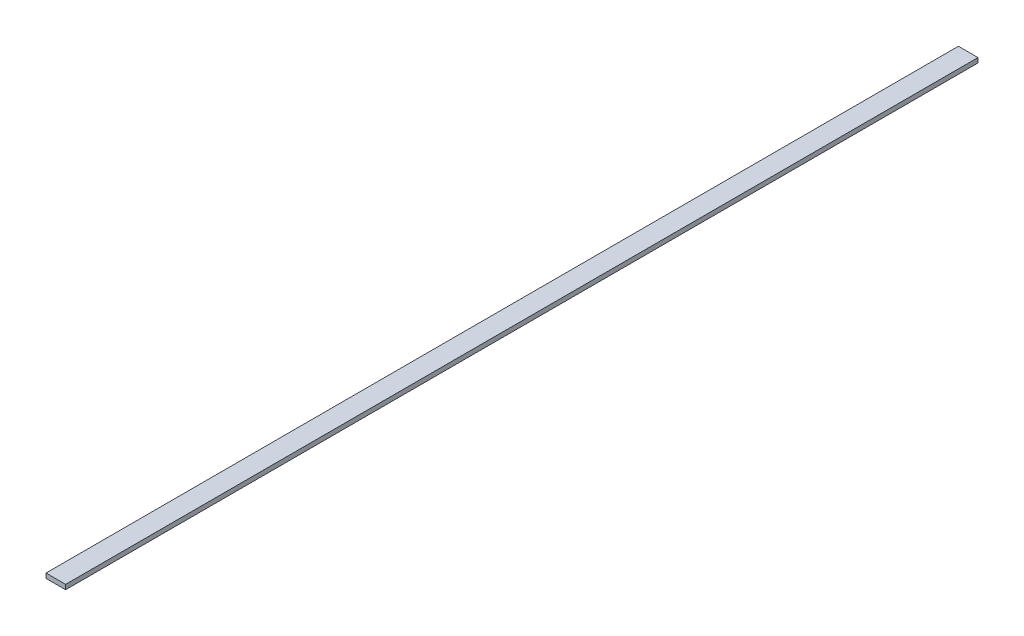
ISO-10303-21;
HEADER;
FILE_DESCRIPTION(('STEP AP214'),'2;1');
FILE_NAME('part.step','',(''),(''),'','','');
FILE_SCHEMA(('AUTOMOTIVE_DESIGN { 1 0 10303 214 1 1 1 1 }'));
ENDSEC;
DATA;
#1=APPLICATION_CONTEXT('core data for automotive mechanical design processes');
#2=APPLICATION_PROTOCOL_DEFINITION('international standard','automotive_design',2000,#1);
#3=PRODUCT_CONTEXT('',#1,'mechanical');
#4=PRODUCT('Part','Part','',(#3));
#5=PRODUCT_RELATED_PRODUCT_CATEGORY('part','',(#4));
#6=PRODUCT_DEFINITION_FORMATION('','',#4);
#7=PRODUCT_DEFINITION_CONTEXT('part definition',#1,'design');
#8=PRODUCT_DEFINITION('design','',#6,#7);
#9=PRODUCT_DEFINITION_SHAPE('','',#8);
#10=(LENGTH_UNIT() NAMED_UNIT(*) SI_UNIT(.MILLI.,.METRE.));
#11=(NAMED_UNIT(*) PLANE_ANGLE_UNIT() SI_UNIT($,.RADIAN.));
#12=(NAMED_UNIT(*) SI_UNIT($,.STERADIAN.) SOLID_ANGLE_UNIT());
#13=UNCERTAINTY_MEASURE_WITH_UNIT(LENGTH_MEASURE(1.E-05),#10,'distance_accuracy_value','');
#14=(GEOMETRIC_REPRESENTATION_CONTEXT(3) GLOBAL_UNCERTAINTY_ASSIGNED_CONTEXT((#13)) GLOBAL_UNIT_ASSIGNED_CONTEXT((#10,
#11,#12)) REPRESENTATION_CONTEXT('',''));
#15=CARTESIAN_POINT('',(0.,0.,0.));
#16=DIRECTION('',(0.,0.,1.));
#17=DIRECTION('',(1.,0.,0.));
#18=AXIS2_PLACEMENT_3D('',#15,#16,#17);
#19=CARTESIAN_POINT('',(0.,0.,295.41216));
#20=DIRECTION('',(1.,0.,0.));
#21=DIRECTION('',(0.,0.,-1.));
#22=AXIS2_PLACEMENT_3D('',#19,#20,#21);
#23=PLANE('',#22);
#24=DIRECTION('',(0.,-1.,0.));
#25=VECTOR('',#24,1.);
#26=CARTESIAN_POINT('',(0.,0.,0.));
#27=LINE('',#26,#25);
#28=CARTESIAN_POINT('',(0.,1.51892,0.));
#29=VERTEX_POINT('',#28);
#30=CARTESIAN_POINT('',(0.,0.,0.));
#31=VERTEX_POINT('',#30);
#32=EDGE_CURVE('E97',#29,#31,#27,.T.);
#33=ORIENTED_EDGE('',*,*,#32,.T.);
#34=DIRECTION('',(0.,0.,-1.));
#35=VECTOR('',#34,1.);
#36=CARTESIAN_POINT('',(0.,0.,295.41216));
#37=LINE('',#36,#35);
#38=CARTESIAN_POINT('',(0.,0.,295.41216));
#39=VERTEX_POINT('',#38);
#40=EDGE_CURVE('E11',#39,#31,#37,.T.);
#41=ORIENTED_EDGE('',*,*,#40,.F.);
#42=DIRECTION('',(0.,-1.,0.));
#43=VECTOR('',#42,1.);
#44=CARTESIAN_POINT('',(0.,0.,295.41216));
#45=LINE('',#44,#43);
#46=CARTESIAN_POINT('',(0.,1.51892,295.41216));
#47=VERTEX_POINT('',#46);
#48=EDGE_CURVE('E85',#47,#39,#45,.T.);
#49=ORIENTED_EDGE('',*,*,#48,.F.);
#50=DIRECTION('',(0.,0.,-1.));
#51=VECTOR('',#50,1.);
#52=CARTESIAN_POINT('',(0.,1.51892,295.41216));
#53=LINE('',#52,#51);
#54=EDGE_CURVE('E93',#47,#29,#53,.T.);
#55=ORIENTED_EDGE('',*,*,#54,.T.);
#56=EDGE_LOOP('',(#33,#41,#49,#55));
#57=FACE_BOUND('',#56,.T.);
#58=ADVANCED_FACE('F34',(#57),#23,.F.);
#59=CARTESIAN_POINT('',(0.,0.,295.41216));
#60=DIRECTION('',(0.,1.,0.));
#61=DIRECTION('',(0.,0.,1.));
#62=AXIS2_PLACEMENT_3D('',#59,#60,#61);
#63=PLANE('',#62);
#64=DIRECTION('',(1.,0.,0.));
#65=VECTOR('',#64,1.);
#66=CARTESIAN_POINT('',(0.,0.,0.));
#67=LINE('',#66,#65);
#68=CARTESIAN_POINT('',(6.35,0.,0.));
#69=VERTEX_POINT('',#68);
#70=EDGE_CURVE('E89',#31,#69,#67,.T.);
#71=ORIENTED_EDGE('',*,*,#70,.T.);
#72=DIRECTION('',(0.,0.,-1.));
#73=VECTOR('',#72,1.);
#74=CARTESIAN_POINT('',(6.35,0.,295.41216));
#75=LINE('',#74,#73);
#76=CARTESIAN_POINT('',(6.35,0.,295.41216));
#77=VERTEX_POINT('',#76);
#78=EDGE_CURVE('E42',#77,#69,#75,.T.);
#79=ORIENTED_EDGE('',*,*,#78,.F.);
#80=DIRECTION('',(1.,0.,0.));
#81=VECTOR('',#80,1.);
#82=CARTESIAN_POINT('',(0.,0.,295.41216));
#83=LINE('',#82,#81);
#84=EDGE_CURVE('E80',#39,#77,#83,.T.);
#85=ORIENTED_EDGE('',*,*,#84,.F.);
#86=ORIENTED_EDGE('',*,*,#40,.T.);
#87=EDGE_LOOP('',(#71,#79,#85,#86));
#88=FACE_BOUND('',#87,.T.);
#89=ADVANCED_FACE('F88',(#88),#63,.F.);
#90=CARTESIAN_POINT('',(6.35,0.,295.41216));
#91=DIRECTION('',(-1.,0.,0.));
#92=DIRECTION('',(0.,0.,1.));
#93=AXIS2_PLACEMENT_3D('',#90,#91,#92);
#94=PLANE('',#93);
#95=DIRECTION('',(0.,1.,0.));
#96=VECTOR('',#95,1.);
#97=CARTESIAN_POINT('',(6.35,0.,0.));
#98=LINE('',#97,#96);
#99=CARTESIAN_POINT('',(6.35,1.51892,0.));
#100=VERTEX_POINT('',#99);
#101=EDGE_CURVE('E67',#69,#100,#98,.T.);
#102=ORIENTED_EDGE('',*,*,#101,.T.);
#103=DIRECTION('',(0.,0.,-1.));
#104=VECTOR('',#103,1.);
#105=CARTESIAN_POINT('',(6.35,1.51892,295.41216));
#106=LINE('',#105,#104);
#107=CARTESIAN_POINT('',(6.35,1.51892,295.41216));
#108=VERTEX_POINT('',#107);
#109=EDGE_CURVE('E90',#108,#100,#106,.T.);
#110=ORIENTED_EDGE('',*,*,#109,.F.);
#111=DIRECTION('',(0.,1.,0.));
#112=VECTOR('',#111,1.);
#113=CARTESIAN_POINT('',(6.35,0.,295.41216));
#114=LINE('',#113,#112);
#115=EDGE_CURVE('E83',#77,#108,#114,.T.);
#116=ORIENTED_EDGE('',*,*,#115,.F.);
#117=ORIENTED_EDGE('',*,*,#78,.T.);
#118=EDGE_LOOP('',(#102,#110,#116,#117));
#119=FACE_BOUND('',#118,.T.);
#120=ADVANCED_FACE('F91',(#119),#94,.F.);
#121=CARTESIAN_POINT('',(0.,1.51892,295.41216));
#122=DIRECTION('',(0.,-1.,0.));
#123=DIRECTION('',(0.,0.,-1.));
#124=AXIS2_PLACEMENT_3D('',#121,#122,#123);
#125=PLANE('',#124);
#126=DIRECTION('',(-1.,0.,0.));
#127=VECTOR('',#126,1.);
#128=CARTESIAN_POINT('',(0.,1.51892,0.));
#129=LINE('',#128,#127);
#130=EDGE_CURVE('E73',#100,#29,#129,.T.);
#131=ORIENTED_EDGE('',*,*,#130,.T.);
#132=ORIENTED_EDGE('',*,*,#54,.F.);
#133=DIRECTION('',(-1.,0.,0.));
#134=VECTOR('',#133,1.);
#135=CARTESIAN_POINT('',(0.,1.51892,295.41216));
#136=LINE('',#135,#134);
#137=EDGE_CURVE('E50',#108,#47,#136,.T.);
#138=ORIENTED_EDGE('',*,*,#137,.F.);
#139=ORIENTED_EDGE('',*,*,#109,.T.);
#140=EDGE_LOOP('',(#131,#132,#138,#139));
#141=FACE_BOUND('',#140,.T.);
#142=ADVANCED_FACE('F104',(#141),#125,.F.);
#143=CARTESIAN_POINT('',(0.,0.,295.41216));
#144=DIRECTION('',(0.,0.,-1.));
#145=DIRECTION('',(-1.,0.,0.));
#146=AXIS2_PLACEMENT_3D('',#143,#144,#145);
#147=PLANE('',#146);
#148=ORIENTED_EDGE('',*,*,#48,.T.);
#149=ORIENTED_EDGE('',*,*,#84,.T.);
#150=ORIENTED_EDGE('',*,*,#115,.T.);
#151=ORIENTED_EDGE('',*,*,#137,.T.);
#152=EDGE_LOOP('',(#148,#149,#150,#151));
#153=FACE_BOUND('',#152,.T.);
#154=ADVANCED_FACE('F81',(#153),#147,.F.);
#155=CARTESIAN_POINT('',(0.,0.,0.));
#156=DIRECTION('',(0.,0.,-1.));
#157=DIRECTION('',(-1.,0.,0.));
#158=AXIS2_PLACEMENT_3D('',#155,#156,#157);
#159=PLANE('',#158);
#160=ORIENTED_EDGE('',*,*,#32,.F.);
#161=ORIENTED_EDGE('',*,*,#130,.F.);
#162=ORIENTED_EDGE('',*,*,#101,.F.);
#163=ORIENTED_EDGE('',*,*,#70,.F.);
#164=EDGE_LOOP('',(#160,#161,#162,#163));
#165=FACE_BOUND('',#164,.T.);
#166=ADVANCED_FACE('F107',(#165),#159,.T.);
#167=CLOSED_SHELL('',(#58,#89,#120,#142,#154,#166));
#168=MANIFOLD_SOLID_BREP('B2',#167);
#169=ADVANCED_BREP_SHAPE_REPRESENTATION('',(#18,#168),#14);
#170=SHAPE_DEFINITION_REPRESENTATION(#9,#169);
ENDSEC;
END-ISO-10303-21;
